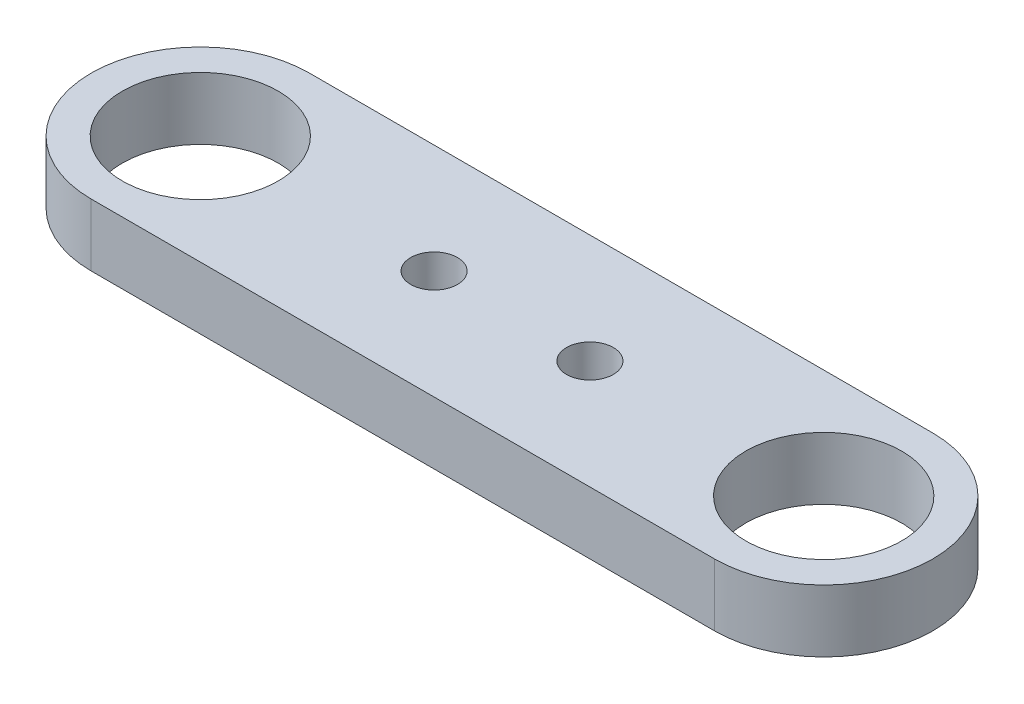
ISO-10303-21;
HEADER;
FILE_DESCRIPTION(('STEP AP214'),'2;1');
FILE_NAME('part.step','',(''),(''),'','','');
FILE_SCHEMA(('AUTOMOTIVE_DESIGN { 1 0 10303 214 1 1 1 1 }'));
ENDSEC;
DATA;
#1=APPLICATION_CONTEXT('core data for automotive mechanical design processes');
#2=APPLICATION_PROTOCOL_DEFINITION('international standard','automotive_design',2000,#1);
#3=PRODUCT_CONTEXT('',#1,'mechanical');
#4=PRODUCT('Part','Part','',(#3));
#5=PRODUCT_RELATED_PRODUCT_CATEGORY('part','',(#4));
#6=PRODUCT_DEFINITION_FORMATION('','',#4);
#7=PRODUCT_DEFINITION_CONTEXT('part definition',#1,'design');
#8=PRODUCT_DEFINITION('design','',#6,#7);
#9=PRODUCT_DEFINITION_SHAPE('','',#8);
#10=(LENGTH_UNIT() NAMED_UNIT(*) SI_UNIT(.MILLI.,.METRE.));
#11=(NAMED_UNIT(*) PLANE_ANGLE_UNIT() SI_UNIT($,.RADIAN.));
#12=(NAMED_UNIT(*) SI_UNIT($,.STERADIAN.) SOLID_ANGLE_UNIT());
#13=UNCERTAINTY_MEASURE_WITH_UNIT(LENGTH_MEASURE(1.E-05),#10,'distance_accuracy_value','');
#14=(GEOMETRIC_REPRESENTATION_CONTEXT(3) GLOBAL_UNCERTAINTY_ASSIGNED_CONTEXT((#13)) GLOBAL_UNIT_ASSIGNED_CONTEXT((#10,
#11,#12)) REPRESENTATION_CONTEXT('',''));
#15=CARTESIAN_POINT('',(0.,0.,0.));
#16=DIRECTION('',(0.,0.,1.));
#17=DIRECTION('',(1.,0.,0.));
#18=AXIS2_PLACEMENT_3D('',#15,#16,#17);
#19=CARTESIAN_POINT('',(-20.,0.,0.));
#20=DIRECTION('',(0.,1.,0.));
#21=DIRECTION('',(1.,0.,0.));
#22=AXIS2_PLACEMENT_3D('',#19,#20,#21);
#23=CYLINDRICAL_SURFACE('',#22,5.);
#24=CARTESIAN_POINT('',(-20.,-1.,0.));
#25=DIRECTION('',(0.,1.,0.));
#26=DIRECTION('',(1.,0.,0.));
#27=AXIS2_PLACEMENT_3D('',#24,#25,#26);
#28=CIRCLE('',#27,5.);
#29=CARTESIAN_POINT('',(-25.,-1.,0.));
#30=VERTEX_POINT('',#29);
#31=EDGE_CURVE('E174',#30,#30,#28,.T.);
#32=ORIENTED_EDGE('',*,*,#31,.T.);
#33=DIRECTION('',(0.,-1.,0.));
#34=VECTOR('',#33,1.);
#35=CARTESIAN_POINT('',(-25.,0.,0.));
#36=LINE('',#35,#34);
#37=CARTESIAN_POINT('',(-25.,-5.,0.));
#38=VERTEX_POINT('',#37);
#39=EDGE_CURVE('E10',#30,#38,#36,.T.);
#40=ORIENTED_EDGE('',*,*,#39,.T.);
#41=CARTESIAN_POINT('',(-20.,-5.,0.));
#42=DIRECTION('',(0.,-1.,0.));
#43=DIRECTION('',(1.,0.,0.));
#44=AXIS2_PLACEMENT_3D('',#41,#42,#43);
#45=CIRCLE('',#44,5.);
#46=EDGE_CURVE('E238',#38,#38,#45,.T.);
#47=ORIENTED_EDGE('',*,*,#46,.T.);
#48=ORIENTED_EDGE('',*,*,#39,.F.);
#49=EDGE_LOOP('',(#32,#40,#47,#48));
#50=FACE_BOUND('',#49,.T.);
#51=ADVANCED_FACE('F15',(#50),#23,.F.);
#52=CARTESIAN_POINT('',(20.,0.,0.));
#53=DIRECTION('',(0.,1.,0.));
#54=DIRECTION('',(1.,0.,0.));
#55=AXIS2_PLACEMENT_3D('',#52,#53,#54);
#56=CYLINDRICAL_SURFACE('',#55,5.);
#57=CARTESIAN_POINT('',(20.,-1.,0.));
#58=DIRECTION('',(0.,1.,0.));
#59=DIRECTION('',(1.,0.,0.));
#60=AXIS2_PLACEMENT_3D('',#57,#58,#59);
#61=CIRCLE('',#60,5.);
#62=CARTESIAN_POINT('',(15.,-1.,0.));
#63=VERTEX_POINT('',#62);
#64=EDGE_CURVE('E182',#63,#63,#61,.T.);
#65=ORIENTED_EDGE('',*,*,#64,.T.);
#66=DIRECTION('',(0.,-1.,0.));
#67=VECTOR('',#66,1.);
#68=CARTESIAN_POINT('',(15.,0.,0.));
#69=LINE('',#68,#67);
#70=CARTESIAN_POINT('',(15.,-5.,0.));
#71=VERTEX_POINT('',#70);
#72=EDGE_CURVE('E25',#63,#71,#69,.T.);
#73=ORIENTED_EDGE('',*,*,#72,.T.);
#74=CARTESIAN_POINT('',(20.,-5.,0.));
#75=DIRECTION('',(0.,-1.,0.));
#76=DIRECTION('',(1.,0.,0.));
#77=AXIS2_PLACEMENT_3D('',#74,#75,#76);
#78=CIRCLE('',#77,5.);
#79=EDGE_CURVE('E121',#71,#71,#78,.T.);
#80=ORIENTED_EDGE('',*,*,#79,.T.);
#81=ORIENTED_EDGE('',*,*,#72,.F.);
#82=EDGE_LOOP('',(#65,#73,#80,#81));
#83=FACE_BOUND('',#82,.T.);
#84=ADVANCED_FACE('F271',(#83),#56,.F.);
#85=CARTESIAN_POINT('',(-20.,0.,0.));
#86=DIRECTION('',(0.,1.,0.));
#87=DIRECTION('',(-1.,0.,0.));
#88=AXIS2_PLACEMENT_3D('',#85,#86,#87);
#89=CYLINDRICAL_SURFACE('',#88,7.00000010430813);
#90=CARTESIAN_POINT('',(-20.,-1.,0.));
#91=DIRECTION('',(0.,-1.,0.));
#92=DIRECTION('',(1.,0.,0.));
#93=AXIS2_PLACEMENT_3D('',#90,#91,#92);
#94=CIRCLE('',#93,7.00000010430813);
#95=CARTESIAN_POINT('',(-20.,-1.,7.00000010430813));
#96=VERTEX_POINT('',#95);
#97=CARTESIAN_POINT('',(-20.,-1.,-7.00000010430813));
#98=VERTEX_POINT('',#97);
#99=EDGE_CURVE('E18',#96,#98,#94,.T.);
#100=ORIENTED_EDGE('',*,*,#99,.T.);
#101=DIRECTION('',(0.,-1.,0.));
#102=VECTOR('',#101,1.);
#103=CARTESIAN_POINT('',(-20.,0.,-7.00000010430813));
#104=LINE('',#103,#102);
#105=CARTESIAN_POINT('',(-20.,-5.,-7.00000010430813));
#106=VERTEX_POINT('',#105);
#107=EDGE_CURVE('E202',#98,#106,#104,.T.);
#108=ORIENTED_EDGE('',*,*,#107,.T.);
#109=CARTESIAN_POINT('',(-20.,-5.,0.));
#110=DIRECTION('',(0.,1.,0.));
#111=DIRECTION('',(1.,0.,0.));
#112=AXIS2_PLACEMENT_3D('',#109,#110,#111);
#113=CIRCLE('',#112,7.00000010430813);
#114=CARTESIAN_POINT('',(-20.,-5.,7.00000010430813));
#115=VERTEX_POINT('',#114);
#116=EDGE_CURVE('E102',#106,#115,#113,.T.);
#117=ORIENTED_EDGE('',*,*,#116,.T.);
#118=DIRECTION('',(0.,1.,0.));
#119=VECTOR('',#118,1.);
#120=CARTESIAN_POINT('',(-20.,0.,7.00000010430813));
#121=LINE('',#120,#119);
#122=EDGE_CURVE('E117',#115,#96,#121,.T.);
#123=ORIENTED_EDGE('',*,*,#122,.T.);
#124=EDGE_LOOP('',(#100,#108,#117,#123));
#125=FACE_BOUND('',#124,.T.);
#126=ADVANCED_FACE('F118',(#125),#89,.T.);
#127=CARTESIAN_POINT('',(5.,4.,0.));
#128=DIRECTION('',(0.,-1.,0.));
#129=DIRECTION('',(-1.,0.,0.));
#130=AXIS2_PLACEMENT_3D('',#127,#128,#129);
#131=CYLINDRICAL_SURFACE('',#130,1.5);
#132=CARTESIAN_POINT('',(5.,-1.,0.));
#133=DIRECTION('',(0.,1.,0.));
#134=DIRECTION('',(-1.,0.,0.));
#135=AXIS2_PLACEMENT_3D('',#132,#133,#134);
#136=CIRCLE('',#135,1.5);
#137=CARTESIAN_POINT('',(6.5,-1.,0.));
#138=VERTEX_POINT('',#137);
#139=EDGE_CURVE('E166',#138,#138,#136,.T.);
#140=ORIENTED_EDGE('',*,*,#139,.T.);
#141=DIRECTION('',(0.,-1.,0.));
#142=VECTOR('',#141,1.);
#143=CARTESIAN_POINT('',(6.5,4.,0.));
#144=LINE('',#143,#142);
#145=CARTESIAN_POINT('',(6.5,-5.,0.));
#146=VERTEX_POINT('',#145);
#147=EDGE_CURVE('E254',#138,#146,#144,.T.);
#148=ORIENTED_EDGE('',*,*,#147,.T.);
#149=CARTESIAN_POINT('',(5.,-5.,0.));
#150=DIRECTION('',(0.,-1.,0.));
#151=DIRECTION('',(-1.,0.,0.));
#152=AXIS2_PLACEMENT_3D('',#149,#150,#151);
#153=CIRCLE('',#152,1.5);
#154=EDGE_CURVE('E231',#146,#146,#153,.T.);
#155=ORIENTED_EDGE('',*,*,#154,.T.);
#156=ORIENTED_EDGE('',*,*,#147,.F.);
#157=EDGE_LOOP('',(#140,#148,#155,#156));
#158=FACE_BOUND('',#157,.T.);
#159=ADVANCED_FACE('F280',(#158),#131,.F.);
#160=CARTESIAN_POINT('',(-5.,4.,0.));
#161=DIRECTION('',(0.,-1.,0.));
#162=DIRECTION('',(-1.,0.,0.));
#163=AXIS2_PLACEMENT_3D('',#160,#161,#162);
#164=CYLINDRICAL_SURFACE('',#163,1.5);
#165=CARTESIAN_POINT('',(-5.,-1.,0.));
#166=DIRECTION('',(0.,1.,0.));
#167=DIRECTION('',(-1.,0.,0.));
#168=AXIS2_PLACEMENT_3D('',#165,#166,#167);
#169=CIRCLE('',#168,1.5);
#170=CARTESIAN_POINT('',(-3.5,-1.,0.));
#171=VERTEX_POINT('',#170);
#172=EDGE_CURVE('E158',#171,#171,#169,.T.);
#173=ORIENTED_EDGE('',*,*,#172,.T.);
#174=DIRECTION('',(0.,-1.,0.));
#175=VECTOR('',#174,1.);
#176=CARTESIAN_POINT('',(-3.5,4.,0.));
#177=LINE('',#176,#175);
#178=CARTESIAN_POINT('',(-3.5,-5.,0.));
#179=VERTEX_POINT('',#178);
#180=EDGE_CURVE('E53',#171,#179,#177,.T.);
#181=ORIENTED_EDGE('',*,*,#180,.T.);
#182=CARTESIAN_POINT('',(-5.,-5.,0.));
#183=DIRECTION('',(0.,-1.,0.));
#184=DIRECTION('',(-1.,0.,0.));
#185=AXIS2_PLACEMENT_3D('',#182,#183,#184);
#186=CIRCLE('',#185,1.5);
#187=EDGE_CURVE('E226',#179,#179,#186,.T.);
#188=ORIENTED_EDGE('',*,*,#187,.T.);
#189=ORIENTED_EDGE('',*,*,#180,.F.);
#190=EDGE_LOOP('',(#173,#181,#188,#189));
#191=FACE_BOUND('',#190,.T.);
#192=ADVANCED_FACE('F291',(#191),#164,.F.);
#193=CARTESIAN_POINT('',(-20.,0.,7.00000010430813));
#194=DIRECTION('',(0.,0.,1.));
#195=DIRECTION('',(1.,0.,0.));
#196=AXIS2_PLACEMENT_3D('',#193,#194,#195);
#197=PLANE('',#196);
#198=DIRECTION('',(-1.,0.,0.));
#199=VECTOR('',#198,1.);
#200=CARTESIAN_POINT('',(-10.,-1.,7.00000010430813));
#201=LINE('',#200,#199);
#202=CARTESIAN_POINT('',(20.,-1.,7.00000010430813));
#203=VERTEX_POINT('',#202);
#204=EDGE_CURVE('E124',#203,#96,#201,.T.);
#205=ORIENTED_EDGE('',*,*,#204,.T.);
#206=ORIENTED_EDGE('',*,*,#122,.F.);
#207=DIRECTION('',(1.,0.,0.));
#208=VECTOR('',#207,1.);
#209=CARTESIAN_POINT('',(-10.,-5.,7.00000010430813));
#210=LINE('',#209,#208);
#211=CARTESIAN_POINT('',(20.,-5.,7.00000010430813));
#212=VERTEX_POINT('',#211);
#213=EDGE_CURVE('E92',#115,#212,#210,.T.);
#214=ORIENTED_EDGE('',*,*,#213,.T.);
#215=DIRECTION('',(0.,1.,0.));
#216=VECTOR('',#215,1.);
#217=CARTESIAN_POINT('',(20.,0.,7.00000010430813));
#218=LINE('',#217,#216);
#219=EDGE_CURVE('E79',#212,#203,#218,.T.);
#220=ORIENTED_EDGE('',*,*,#219,.T.);
#221=EDGE_LOOP('',(#205,#206,#214,#220));
#222=FACE_BOUND('',#221,.T.);
#223=ADVANCED_FACE('F125',(#222),#197,.T.);
#224=CARTESIAN_POINT('',(0.,-5.,0.));
#225=DIRECTION('',(0.,1.,0.));
#226=DIRECTION('',(1.,0.,0.));
#227=AXIS2_PLACEMENT_3D('',#224,#225,#226);
#228=PLANE('',#227);
#229=ORIENTED_EDGE('',*,*,#79,.F.);
#230=EDGE_LOOP('',(#229));
#231=FACE_BOUND('',#230,.T.);
#232=ORIENTED_EDGE('',*,*,#46,.F.);
#233=EDGE_LOOP('',(#232));
#234=FACE_BOUND('',#233,.T.);
#235=ORIENTED_EDGE('',*,*,#154,.F.);
#236=EDGE_LOOP('',(#235));
#237=FACE_BOUND('',#236,.T.);
#238=ORIENTED_EDGE('',*,*,#187,.F.);
#239=EDGE_LOOP('',(#238));
#240=FACE_BOUND('',#239,.T.);
#241=ORIENTED_EDGE('',*,*,#116,.F.);
#242=DIRECTION('',(-1.,0.,0.));
#243=VECTOR('',#242,1.);
#244=CARTESIAN_POINT('',(10.,-5.,-7.00000010430813));
#245=LINE('',#244,#243);
#246=CARTESIAN_POINT('',(20.,-5.,-7.00000010430813));
#247=VERTEX_POINT('',#246);
#248=EDGE_CURVE('E194',#247,#106,#245,.T.);
#249=ORIENTED_EDGE('',*,*,#248,.F.);
#250=CARTESIAN_POINT('',(20.,-5.,0.));
#251=DIRECTION('',(0.,1.,0.));
#252=DIRECTION('',(1.,0.,0.));
#253=AXIS2_PLACEMENT_3D('',#250,#251,#252);
#254=CIRCLE('',#253,7.00000010430813);
#255=EDGE_CURVE('E212',#212,#247,#254,.T.);
#256=ORIENTED_EDGE('',*,*,#255,.F.);
#257=ORIENTED_EDGE('',*,*,#213,.F.);
#258=EDGE_LOOP('',(#241,#249,#256,#257));
#259=FACE_BOUND('',#258,.T.);
#260=ADVANCED_FACE('F302',(#231,#234,#237,#240,#259),#228,.F.);
#261=CARTESIAN_POINT('',(20.,0.,0.));
#262=DIRECTION('',(0.,1.,0.));
#263=DIRECTION('',(1.,0.,0.));
#264=AXIS2_PLACEMENT_3D('',#261,#262,#263);
#265=CYLINDRICAL_SURFACE('',#264,7.00000010430813);
#266=CARTESIAN_POINT('',(20.,-1.,0.));
#267=DIRECTION('',(0.,-1.,0.));
#268=DIRECTION('',(1.,0.,0.));
#269=AXIS2_PLACEMENT_3D('',#266,#267,#268);
#270=CIRCLE('',#269,7.00000010430813);
#271=CARTESIAN_POINT('',(20.,-1.,-7.00000010430813));
#272=VERTEX_POINT('',#271);
#273=EDGE_CURVE('E129',#272,#203,#270,.T.);
#274=ORIENTED_EDGE('',*,*,#273,.T.);
#275=ORIENTED_EDGE('',*,*,#219,.F.);
#276=ORIENTED_EDGE('',*,*,#255,.T.);
#277=DIRECTION('',(0.,1.,0.));
#278=VECTOR('',#277,1.);
#279=CARTESIAN_POINT('',(20.,0.,-7.00000010430813));
#280=LINE('',#279,#278);
#281=EDGE_CURVE('E66',#247,#272,#280,.T.);
#282=ORIENTED_EDGE('',*,*,#281,.T.);
#283=EDGE_LOOP('',(#274,#275,#276,#282));
#284=FACE_BOUND('',#283,.T.);
#285=ADVANCED_FACE('F310',(#284),#265,.T.);
#286=CARTESIAN_POINT('',(20.,0.,-7.00000010430813));
#287=DIRECTION('',(0.,0.,-1.));
#288=DIRECTION('',(0.,-1.,0.));
#289=AXIS2_PLACEMENT_3D('',#286,#287,#288);
#290=PLANE('',#289);
#291=DIRECTION('',(1.,0.,0.));
#292=VECTOR('',#291,1.);
#293=CARTESIAN_POINT('',(10.,-1.,-7.00000010430813));
#294=LINE('',#293,#292);
#295=EDGE_CURVE('E133',#98,#272,#294,.T.);
#296=ORIENTED_EDGE('',*,*,#295,.T.);
#297=ORIENTED_EDGE('',*,*,#281,.F.);
#298=ORIENTED_EDGE('',*,*,#248,.T.);
#299=ORIENTED_EDGE('',*,*,#107,.F.);
#300=EDGE_LOOP('',(#296,#297,#298,#299));
#301=FACE_BOUND('',#300,.T.);
#302=ADVANCED_FACE('F324',(#301),#290,.T.);
#303=CARTESIAN_POINT('',(0.,-1.,0.));
#304=DIRECTION('',(0.,1.,0.));
#305=DIRECTION('',(1.,0.,0.));
#306=AXIS2_PLACEMENT_3D('',#303,#304,#305);
#307=PLANE('',#306);
#308=ORIENTED_EDGE('',*,*,#64,.F.);
#309=EDGE_LOOP('',(#308));
#310=FACE_BOUND('',#309,.T.);
#311=ORIENTED_EDGE('',*,*,#31,.F.);
#312=EDGE_LOOP('',(#311));
#313=FACE_BOUND('',#312,.T.);
#314=ORIENTED_EDGE('',*,*,#139,.F.);
#315=EDGE_LOOP('',(#314));
#316=FACE_BOUND('',#315,.T.);
#317=ORIENTED_EDGE('',*,*,#172,.F.);
#318=EDGE_LOOP('',(#317));
#319=FACE_BOUND('',#318,.T.);
#320=ORIENTED_EDGE('',*,*,#99,.F.);
#321=ORIENTED_EDGE('',*,*,#204,.F.);
#322=ORIENTED_EDGE('',*,*,#273,.F.);
#323=ORIENTED_EDGE('',*,*,#295,.F.);
#324=EDGE_LOOP('',(#320,#321,#322,#323));
#325=FACE_BOUND('',#324,.T.);
#326=ADVANCED_FACE('F132',(#310,#313,#316,#319,#325),#307,.T.);
#327=CLOSED_SHELL('',(#51,#84,#126,#159,#192,#223,#260,#285,#302,#326));
#328=MANIFOLD_SOLID_BREP('B1',#327);
#329=ADVANCED_BREP_SHAPE_REPRESENTATION('',(#18,#328),#14);
#330=SHAPE_DEFINITION_REPRESENTATION(#9,#329);
ENDSEC;
END-ISO-10303-21;
